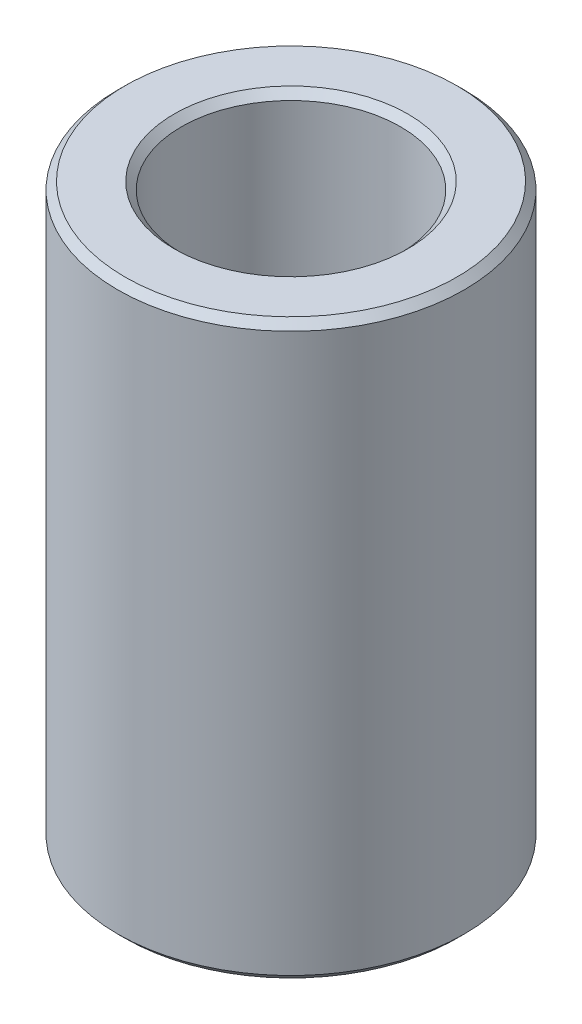
ISO-10303-21;
HEADER;
FILE_DESCRIPTION(('STEP AP214'),'2;1');
FILE_NAME('part.step','',(''),(''),'','','');
FILE_SCHEMA(('AUTOMOTIVE_DESIGN { 1 0 10303 214 1 1 1 1 }'));
ENDSEC;
DATA;
#1=APPLICATION_CONTEXT('core data for automotive mechanical design processes');
#2=APPLICATION_PROTOCOL_DEFINITION('international standard','automotive_design',2000,#1);
#3=PRODUCT_CONTEXT('',#1,'mechanical');
#4=PRODUCT('Part','Part','',(#3));
#5=PRODUCT_RELATED_PRODUCT_CATEGORY('part','',(#4));
#6=PRODUCT_DEFINITION_FORMATION('','',#4);
#7=PRODUCT_DEFINITION_CONTEXT('part definition',#1,'design');
#8=PRODUCT_DEFINITION('design','',#6,#7);
#9=PRODUCT_DEFINITION_SHAPE('','',#8);
#10=(LENGTH_UNIT() NAMED_UNIT(*) SI_UNIT(.MILLI.,.METRE.));
#11=(NAMED_UNIT(*) PLANE_ANGLE_UNIT() SI_UNIT($,.RADIAN.));
#12=(NAMED_UNIT(*) SI_UNIT($,.STERADIAN.) SOLID_ANGLE_UNIT());
#13=UNCERTAINTY_MEASURE_WITH_UNIT(LENGTH_MEASURE(1.E-05),#10,'distance_accuracy_value','');
#14=(GEOMETRIC_REPRESENTATION_CONTEXT(3) GLOBAL_UNCERTAINTY_ASSIGNED_CONTEXT((#13)) GLOBAL_UNIT_ASSIGNED_CONTEXT((#10,
#11,#12)) REPRESENTATION_CONTEXT('',''));
#15=CARTESIAN_POINT('',(0.,0.,0.));
#16=DIRECTION('',(0.,0.,1.));
#17=DIRECTION('',(1.,0.,0.));
#18=AXIS2_PLACEMENT_3D('',#15,#16,#17);
#19=CARTESIAN_POINT('',(0.,123.970160326474,0.));
#20=DIRECTION('',(0.,-1.,0.));
#21=DIRECTION('',(0.,0.,-1.));
#22=AXIS2_PLACEMENT_3D('',#19,#20,#21);
#23=CYLINDRICAL_SURFACE('',#22,37.5);
#24=CARTESIAN_POINT('',(0.,1.59419146137144,0.));
#25=DIRECTION('',(0.,1.,0.));
#26=DIRECTION('',(0.,0.,1.));
#27=AXIS2_PLACEMENT_3D('',#24,#25,#26);
#28=CIRCLE('',#27,37.5);
#29=CARTESIAN_POINT('',(0.,1.59419146137144,37.5));
#30=VERTEX_POINT('',#29);
#31=EDGE_CURVE('E10',#30,#30,#28,.T.);
#32=ORIENTED_EDGE('',*,*,#31,.T.);
#33=EDGE_LOOP('',(#32));
#34=FACE_BOUND('',#33,.T.);
#35=CARTESIAN_POINT('',(0.,122.375968865103,0.));
#36=DIRECTION('',(0.,1.,0.));
#37=DIRECTION('',(0.,0.,1.));
#38=AXIS2_PLACEMENT_3D('',#35,#36,#37);
#39=CIRCLE('',#38,37.5);
#40=CARTESIAN_POINT('',(0.,122.375968865103,37.5));
#41=VERTEX_POINT('',#40);
#42=EDGE_CURVE('E50',#41,#41,#39,.F.);
#43=ORIENTED_EDGE('',*,*,#42,.T.);
#44=EDGE_LOOP('',(#43));
#45=FACE_BOUND('',#44,.T.);
#46=ADVANCED_FACE('F39',(#34,#45),#23,.T.);
#47=CARTESIAN_POINT('',(0.,123.970160326474,0.));
#48=DIRECTION('',(0.,1.,0.));
#49=DIRECTION('',(0.,0.,1.));
#50=AXIS2_PLACEMENT_3D('',#47,#48,#49);
#51=PLANE('',#50);
#52=CARTESIAN_POINT('',(0.,123.970160326474,0.));
#53=DIRECTION('',(0.,1.,0.));
#54=DIRECTION('',(0.,0.,1.));
#55=AXIS2_PLACEMENT_3D('',#52,#53,#54);
#56=CIRCLE('',#55,25.2998962716421);
#57=CARTESIAN_POINT('',(0.,123.970160326474,25.2998962716421));
#58=VERTEX_POINT('',#57);
#59=EDGE_CURVE('E58',#58,#58,#56,.F.);
#60=ORIENTED_EDGE('',*,*,#59,.T.);
#61=EDGE_LOOP('',(#60));
#62=FACE_BOUND('',#61,.T.);
#63=CARTESIAN_POINT('',(0.,123.970160326474,0.));
#64=DIRECTION('',(0.,1.,0.));
#65=DIRECTION('',(0.,0.,1.));
#66=AXIS2_PLACEMENT_3D('',#63,#64,#65);
#67=CIRCLE('',#66,35.9058085386285);
#68=CARTESIAN_POINT('',(0.,123.970160326474,35.9058085386285));
#69=VERTEX_POINT('',#68);
#70=EDGE_CURVE('E61',#69,#69,#67,.T.);
#71=ORIENTED_EDGE('',*,*,#70,.T.);
#72=EDGE_LOOP('',(#71));
#73=FACE_BOUND('',#72,.T.);
#74=ADVANCED_FACE('F88',(#62,#73),#51,.T.);
#75=CARTESIAN_POINT('',(0.,0.,0.));
#76=DIRECTION('',(0.,1.,0.));
#77=DIRECTION('',(0.,0.,1.));
#78=AXIS2_PLACEMENT_3D('',#75,#76,#77);
#79=PLANE('',#78);
#80=CARTESIAN_POINT('',(0.,0.,0.));
#81=DIRECTION('',(0.,1.,0.));
#82=DIRECTION('',(0.,0.,1.));
#83=AXIS2_PLACEMENT_3D('',#80,#81,#82);
#84=CIRCLE('',#83,25.2998962716421);
#85=CARTESIAN_POINT('',(0.,0.,25.2998962716421));
#86=VERTEX_POINT('',#85);
#87=EDGE_CURVE('E51',#86,#86,#84,.T.);
#88=ORIENTED_EDGE('',*,*,#87,.T.);
#89=EDGE_LOOP('',(#88));
#90=FACE_BOUND('',#89,.T.);
#91=CARTESIAN_POINT('',(0.,0.,0.));
#92=DIRECTION('',(0.,1.,0.));
#93=DIRECTION('',(0.,0.,1.));
#94=AXIS2_PLACEMENT_3D('',#91,#92,#93);
#95=CIRCLE('',#94,35.9058085386285);
#96=CARTESIAN_POINT('',(0.,0.,35.9058085386285));
#97=VERTEX_POINT('',#96);
#98=EDGE_CURVE('E54',#97,#97,#95,.F.);
#99=ORIENTED_EDGE('',*,*,#98,.T.);
#100=EDGE_LOOP('',(#99));
#101=FACE_BOUND('',#100,.T.);
#102=ADVANCED_FACE('F83',(#90,#101),#79,.F.);
#103=CARTESIAN_POINT('',(0.,123.970160326474,0.));
#104=DIRECTION('',(0.,-1.,0.));
#105=DIRECTION('',(0.,0.,-1.));
#106=AXIS2_PLACEMENT_3D('',#103,#104,#105);
#107=CYLINDRICAL_SURFACE('',#106,23.7057048102706);
#108=CARTESIAN_POINT('',(0.,122.375968865103,0.));
#109=DIRECTION('',(0.,1.,0.));
#110=DIRECTION('',(0.,0.,1.));
#111=AXIS2_PLACEMENT_3D('',#108,#109,#110);
#112=CIRCLE('',#111,23.7057048102706);
#113=CARTESIAN_POINT('',(0.,122.375968865103,23.7057048102706));
#114=VERTEX_POINT('',#113);
#115=EDGE_CURVE('E67',#114,#114,#112,.T.);
#116=ORIENTED_EDGE('',*,*,#115,.T.);
#117=EDGE_LOOP('',(#116));
#118=FACE_BOUND('',#117,.T.);
#119=CARTESIAN_POINT('',(0.,1.59419146137151,0.));
#120=DIRECTION('',(0.,1.,0.));
#121=DIRECTION('',(0.,0.,1.));
#122=AXIS2_PLACEMENT_3D('',#119,#120,#121);
#123=CIRCLE('',#122,23.7057048102706);
#124=CARTESIAN_POINT('',(0.,1.59419146137151,23.7057048102706));
#125=VERTEX_POINT('',#124);
#126=EDGE_CURVE('E69',#125,#125,#123,.F.);
#127=ORIENTED_EDGE('',*,*,#126,.T.);
#128=EDGE_LOOP('',(#127));
#129=FACE_BOUND('',#128,.T.);
#130=ADVANCED_FACE('F71',(#118,#129),#107,.F.);
#131=CARTESIAN_POINT('',(0.,122.375968865103,0.));
#132=DIRECTION('',(0.,1.,0.));
#133=DIRECTION('',(0.,0.,1.));
#134=AXIS2_PLACEMENT_3D('',#131,#132,#133);
#135=CONICAL_SURFACE('',#134,23.7057048102706,0.785398163397448);
#136=ORIENTED_EDGE('',*,*,#59,.F.);
#137=EDGE_LOOP('',(#136));
#138=FACE_BOUND('',#137,.T.);
#139=ORIENTED_EDGE('',*,*,#115,.F.);
#140=EDGE_LOOP('',(#139));
#141=FACE_BOUND('',#140,.T.);
#142=ADVANCED_FACE('F77',(#138,#141),#135,.F.);
#143=CARTESIAN_POINT('',(0.,0.,0.));
#144=DIRECTION('',(0.,-1.,0.));
#145=DIRECTION('',(0.,0.,-1.));
#146=AXIS2_PLACEMENT_3D('',#143,#144,#145);
#147=CONICAL_SURFACE('',#146,25.2998962716421,0.785398163397444);
#148=ORIENTED_EDGE('',*,*,#126,.F.);
#149=EDGE_LOOP('',(#148));
#150=FACE_BOUND('',#149,.T.);
#151=ORIENTED_EDGE('',*,*,#87,.F.);
#152=EDGE_LOOP('',(#151));
#153=FACE_BOUND('',#152,.T.);
#154=ADVANCED_FACE('F73',(#150,#153),#147,.F.);
#155=CARTESIAN_POINT('',(0.,1.59419146137144,0.));
#156=DIRECTION('',(0.,1.,0.));
#157=DIRECTION('',(0.,0.,1.));
#158=AXIS2_PLACEMENT_3D('',#155,#156,#157);
#159=CONICAL_SURFACE('',#158,37.5,0.785398163397457);
#160=ORIENTED_EDGE('',*,*,#98,.F.);
#161=EDGE_LOOP('',(#160));
#162=FACE_BOUND('',#161,.T.);
#163=ORIENTED_EDGE('',*,*,#31,.F.);
#164=EDGE_LOOP('',(#163));
#165=FACE_BOUND('',#164,.T.);
#166=ADVANCED_FACE('F76',(#162,#165),#159,.T.);
#167=CARTESIAN_POINT('',(0.,123.970160326474,0.));
#168=DIRECTION('',(0.,-1.,0.));
#169=DIRECTION('',(0.,0.,-1.));
#170=AXIS2_PLACEMENT_3D('',#167,#168,#169);
#171=CONICAL_SURFACE('',#170,35.9058085386285,0.785398163397444);
#172=ORIENTED_EDGE('',*,*,#42,.F.);
#173=EDGE_LOOP('',(#172));
#174=FACE_BOUND('',#173,.T.);
#175=ORIENTED_EDGE('',*,*,#70,.F.);
#176=EDGE_LOOP('',(#175));
#177=FACE_BOUND('',#176,.T.);
#178=ADVANCED_FACE('F45',(#174,#177),#171,.T.);
#179=CLOSED_SHELL('',(#46,#74,#102,#130,#142,#154,#166,#178));
#180=MANIFOLD_SOLID_BREP('B2',#179);
#181=ADVANCED_BREP_SHAPE_REPRESENTATION('',(#18,#180),#14);
#182=SHAPE_DEFINITION_REPRESENTATION(#9,#181);
ENDSEC;
END-ISO-10303-21;
